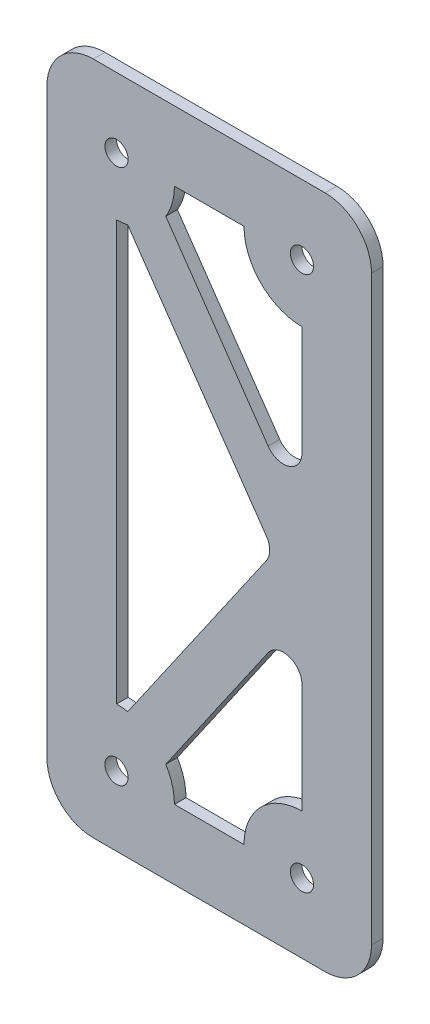
ISO-10303-21;
HEADER;
FILE_DESCRIPTION(('STEP AP214'),'2;1');
FILE_NAME('part.step','',(''),(''),'','','');
FILE_SCHEMA(('AUTOMOTIVE_DESIGN { 1 0 10303 214 1 1 1 1 }'));
ENDSEC;
DATA;
#1=APPLICATION_CONTEXT('core data for automotive mechanical design processes');
#2=APPLICATION_PROTOCOL_DEFINITION('international standard','automotive_design',2000,#1);
#3=PRODUCT_CONTEXT('',#1,'mechanical');
#4=PRODUCT('Part','Part','',(#3));
#5=PRODUCT_RELATED_PRODUCT_CATEGORY('part','',(#4));
#6=PRODUCT_DEFINITION_FORMATION('','',#4);
#7=PRODUCT_DEFINITION_CONTEXT('part definition',#1,'design');
#8=PRODUCT_DEFINITION('design','',#6,#7);
#9=PRODUCT_DEFINITION_SHAPE('','',#8);
#10=(LENGTH_UNIT() NAMED_UNIT(*) SI_UNIT(.MILLI.,.METRE.));
#11=(NAMED_UNIT(*) PLANE_ANGLE_UNIT() SI_UNIT($,.RADIAN.));
#12=(NAMED_UNIT(*) SI_UNIT($,.STERADIAN.) SOLID_ANGLE_UNIT());
#13=UNCERTAINTY_MEASURE_WITH_UNIT(LENGTH_MEASURE(1.E-05),#10,'distance_accuracy_value','');
#14=(GEOMETRIC_REPRESENTATION_CONTEXT(3) GLOBAL_UNCERTAINTY_ASSIGNED_CONTEXT((#13)) GLOBAL_UNIT_ASSIGNED_CONTEXT((#10,
#11,#12)) REPRESENTATION_CONTEXT('',''));
#15=CARTESIAN_POINT('',(0.,0.,0.));
#16=DIRECTION('',(0.,0.,1.));
#17=DIRECTION('',(1.,0.,0.));
#18=AXIS2_PLACEMENT_3D('',#15,#16,#17);
#19=CARTESIAN_POINT('',(1667.86072109709,0.,3.175));
#20=DIRECTION('',(1.,0.,0.));
#21=DIRECTION('',(0.,0.,-1.));
#22=AXIS2_PLACEMENT_3D('',#19,#20,#21);
#23=PLANE('',#22);
#24=DIRECTION('',(0.,-1.,0.));
#25=VECTOR('',#24,1.);
#26=CARTESIAN_POINT('',(1667.86072109709,0.,0.));
#27=LINE('',#26,#25);
#28=CARTESIAN_POINT('',(1667.86072109709,-4100.18496013182,0.));
#29=VERTEX_POINT('',#28);
#30=CARTESIAN_POINT('',(1667.86072109709,-4259.54741898572,0.));
#31=VERTEX_POINT('',#30);
#32=EDGE_CURVE('E461',#29,#31,#27,.T.);
#33=ORIENTED_EDGE('',*,*,#32,.F.);
#34=DIRECTION('',(0.,0.,-1.));
#35=VECTOR('',#34,1.);
#36=CARTESIAN_POINT('',(1667.86072109709,-4100.18496013182,3.175));
#37=LINE('',#36,#35);
#38=CARTESIAN_POINT('',(1667.86072109709,-4100.18496013182,3.175));
#39=VERTEX_POINT('',#38);
#40=EDGE_CURVE('E314',#29,#39,#37,.F.);
#41=ORIENTED_EDGE('',*,*,#40,.T.);
#42=DIRECTION('',(0.,-1.,0.));
#43=VECTOR('',#42,1.);
#44=CARTESIAN_POINT('',(1667.86072109709,0.,3.175));
#45=LINE('',#44,#43);
#46=CARTESIAN_POINT('',(1667.86072109709,-4259.54741898572,3.175));
#47=VERTEX_POINT('',#46);
#48=EDGE_CURVE('E490',#39,#47,#45,.T.);
#49=ORIENTED_EDGE('',*,*,#48,.T.);
#50=DIRECTION('',(0.,0.,-1.));
#51=VECTOR('',#50,1.);
#52=CARTESIAN_POINT('',(1667.86072109709,-4259.54741898572,0.));
#53=LINE('',#52,#51);
#54=EDGE_CURVE('E310',#47,#31,#53,.T.);
#55=ORIENTED_EDGE('',*,*,#54,.T.);
#56=EDGE_LOOP('',(#33,#41,#49,#55));
#57=FACE_BOUND('',#56,.T.);
#58=ADVANCED_FACE('F38',(#57),#23,.T.);
#59=CARTESIAN_POINT('',(0.,-4087.48496013182,3.175));
#60=DIRECTION('',(0.,1.,0.));
#61=DIRECTION('',(0.,0.,1.));
#62=AXIS2_PLACEMENT_3D('',#59,#60,#61);
#63=PLANE('',#62);
#64=DIRECTION('',(1.,0.,0.));
#65=VECTOR('',#64,1.);
#66=CARTESIAN_POINT('',(0.,-4087.48496013182,3.175));
#67=LINE('',#66,#65);
#68=CARTESIAN_POINT('',(1591.66072109709,-4087.48496013182,3.175));
#69=VERTEX_POINT('',#68);
#70=CARTESIAN_POINT('',(1655.16072109709,-4087.48496013182,3.175));
#71=VERTEX_POINT('',#70);
#72=EDGE_CURVE('E481',#69,#71,#67,.T.);
#73=ORIENTED_EDGE('',*,*,#72,.T.);
#74=DIRECTION('',(0.,0.,-1.));
#75=VECTOR('',#74,1.);
#76=CARTESIAN_POINT('',(1655.16072109709,-4087.48496013182,3.175));
#77=LINE('',#76,#75);
#78=CARTESIAN_POINT('',(1655.16072109709,-4087.48496013182,0.));
#79=VERTEX_POINT('',#78);
#80=EDGE_CURVE('E294',#71,#79,#77,.T.);
#81=ORIENTED_EDGE('',*,*,#80,.T.);
#82=DIRECTION('',(1.,0.,0.));
#83=VECTOR('',#82,1.);
#84=CARTESIAN_POINT('',(0.,-4087.48496013182,0.));
#85=LINE('',#84,#83);
#86=CARTESIAN_POINT('',(1591.66072109709,-4087.48496013182,0.));
#87=VERTEX_POINT('',#86);
#88=EDGE_CURVE('E357',#87,#79,#85,.T.);
#89=ORIENTED_EDGE('',*,*,#88,.F.);
#90=DIRECTION('',(0.,0.,-1.));
#91=VECTOR('',#90,1.);
#92=CARTESIAN_POINT('',(1591.66072109709,-4087.48496013182,3.175));
#93=LINE('',#92,#91);
#94=EDGE_CURVE('E291',#87,#69,#93,.F.);
#95=ORIENTED_EDGE('',*,*,#94,.T.);
#96=EDGE_LOOP('',(#73,#81,#89,#95));
#97=FACE_BOUND('',#96,.T.);
#98=ADVANCED_FACE('F471',(#97),#63,.T.);
#99=CARTESIAN_POINT('',(1578.96072109709,0.,3.175));
#100=DIRECTION('',(1.,0.,0.));
#101=DIRECTION('',(0.,0.,-1.));
#102=AXIS2_PLACEMENT_3D('',#99,#100,#101);
#103=PLANE('',#102);
#104=DIRECTION('',(0.,-1.,0.));
#105=VECTOR('',#104,1.);
#106=CARTESIAN_POINT('',(1578.96072109709,0.,3.175));
#107=LINE('',#106,#105);
#108=CARTESIAN_POINT('',(1578.96072109709,-4100.18496013182,3.175));
#109=VERTEX_POINT('',#108);
#110=CARTESIAN_POINT('',(1578.96072109709,-4259.54741898572,3.175));
#111=VERTEX_POINT('',#110);
#112=EDGE_CURVE('E480',#109,#111,#107,.T.);
#113=ORIENTED_EDGE('',*,*,#112,.F.);
#114=DIRECTION('',(0.,0.,-1.));
#115=VECTOR('',#114,1.);
#116=CARTESIAN_POINT('',(1578.96072109709,-4100.18496013182,0.));
#117=LINE('',#116,#115);
#118=CARTESIAN_POINT('',(1578.96072109709,-4100.18496013182,0.));
#119=VERTEX_POINT('',#118);
#120=EDGE_CURVE('E331',#109,#119,#117,.T.);
#121=ORIENTED_EDGE('',*,*,#120,.T.);
#122=DIRECTION('',(0.,-1.,0.));
#123=VECTOR('',#122,1.);
#124=CARTESIAN_POINT('',(1578.96072109709,0.,0.));
#125=LINE('',#124,#123);
#126=CARTESIAN_POINT('',(1578.96072109709,-4259.54741898572,0.));
#127=VERTEX_POINT('',#126);
#128=EDGE_CURVE('E351',#119,#127,#125,.T.);
#129=ORIENTED_EDGE('',*,*,#128,.T.);
#130=DIRECTION('',(0.,0.,-1.));
#131=VECTOR('',#130,1.);
#132=CARTESIAN_POINT('',(1578.96072109709,-4259.54741898572,3.175));
#133=LINE('',#132,#131);
#134=EDGE_CURVE('E328',#127,#111,#133,.F.);
#135=ORIENTED_EDGE('',*,*,#134,.T.);
#136=EDGE_LOOP('',(#113,#121,#129,#135));
#137=FACE_BOUND('',#136,.T.);
#138=ADVANCED_FACE('F483',(#137),#103,.F.);
#139=CARTESIAN_POINT('',(1648.81072109709,-4253.19741898572,3.175));
#140=DIRECTION('',(0.,0.,-1.));
#141=DIRECTION('',(-1.,0.,0.));
#142=AXIS2_PLACEMENT_3D('',#139,#140,#141);
#143=CYLINDRICAL_SURFACE('',#142,15.8749999999997);
#144=CARTESIAN_POINT('',(1648.81072109709,-4253.19741898572,0.));
#145=DIRECTION('',(0.,0.,1.));
#146=DIRECTION('',(1.,0.,0.));
#147=AXIS2_PLACEMENT_3D('',#144,#145,#146);
#148=CIRCLE('',#147,15.8749999999997);
#149=CARTESIAN_POINT('',(1648.81072109709,-4237.32241898572,0.));
#150=VERTEX_POINT('',#149);
#151=CARTESIAN_POINT('',(1632.93572109709,-4253.19741898572,0.));
#152=VERTEX_POINT('',#151);
#153=EDGE_CURVE('E439',#150,#152,#148,.T.);
#154=ORIENTED_EDGE('',*,*,#153,.T.);
#155=DIRECTION('',(0.,0.,-1.));
#156=VECTOR('',#155,1.);
#157=CARTESIAN_POINT('',(1632.93572109709,-4253.19741898572,3.175));
#158=LINE('',#157,#156);
#159=CARTESIAN_POINT('',(1632.93572109709,-4253.19741898572,3.175));
#160=VERTEX_POINT('',#159);
#161=EDGE_CURVE('E258',#160,#152,#158,.T.);
#162=ORIENTED_EDGE('',*,*,#161,.F.);
#163=CARTESIAN_POINT('',(1648.81072109709,-4253.19741898572,3.175));
#164=DIRECTION('',(0.,0.,1.));
#165=DIRECTION('',(1.,0.,0.));
#166=AXIS2_PLACEMENT_3D('',#163,#164,#165);
#167=CIRCLE('',#166,15.8749999999997);
#168=CARTESIAN_POINT('',(1648.81072109709,-4237.32241898572,3.175));
#169=VERTEX_POINT('',#168);
#170=EDGE_CURVE('E528',#169,#160,#167,.T.);
#171=ORIENTED_EDGE('',*,*,#170,.F.);
#172=DIRECTION('',(0.,0.,-1.));
#173=VECTOR('',#172,1.);
#174=CARTESIAN_POINT('',(1648.81072109709,-4237.32241898572,3.175));
#175=LINE('',#174,#173);
#176=EDGE_CURVE('E361',#169,#150,#175,.T.);
#177=ORIENTED_EDGE('',*,*,#176,.T.);
#178=EDGE_LOOP('',(#154,#162,#171,#177));
#179=FACE_BOUND('',#178,.T.);
#180=ADVANCED_FACE('F597',(#179),#143,.T.);
#181=CARTESIAN_POINT('',(7.43621685485709E-11,-4253.19741898575,3.175));
#182=DIRECTION('',(0.,-1.,0.));
#183=DIRECTION('',(1.,0.,0.));
#184=AXIS2_PLACEMENT_3D('',#181,#182,#183);
#185=PLANE('',#184);
#186=DIRECTION('',(-1.,0.,0.));
#187=VECTOR('',#186,1.);
#188=CARTESIAN_POINT('',(7.43621685485709E-11,-4253.19741898575,0.));
#189=LINE('',#188,#187);
#190=CARTESIAN_POINT('',(1613.88572109709,-4253.19741898572,0.));
#191=VERTEX_POINT('',#190);
#192=EDGE_CURVE('E443',#152,#191,#189,.T.);
#193=ORIENTED_EDGE('',*,*,#192,.T.);
#194=DIRECTION('',(0.,0.,-1.));
#195=VECTOR('',#194,1.);
#196=CARTESIAN_POINT('',(1613.88572109709,-4253.19741898572,3.175));
#197=LINE('',#196,#195);
#198=CARTESIAN_POINT('',(1613.88572109709,-4253.19741898572,3.175));
#199=VERTEX_POINT('',#198);
#200=EDGE_CURVE('E370',#199,#191,#197,.T.);
#201=ORIENTED_EDGE('',*,*,#200,.F.);
#202=DIRECTION('',(-1.,0.,0.));
#203=VECTOR('',#202,1.);
#204=CARTESIAN_POINT('',(7.43621685485709E-11,-4253.19741898575,3.175));
#205=LINE('',#204,#203);
#206=EDGE_CURVE('E532',#160,#199,#205,.T.);
#207=ORIENTED_EDGE('',*,*,#206,.F.);
#208=ORIENTED_EDGE('',*,*,#161,.T.);
#209=EDGE_LOOP('',(#193,#201,#207,#208));
#210=FACE_BOUND('',#209,.T.);
#211=ADVANCED_FACE('F593',(#210),#185,.F.);
#212=CARTESIAN_POINT('',(1598.01072109709,-4253.19741898572,3.175));
#213=DIRECTION('',(0.,0.,-1.));
#214=DIRECTION('',(-1.,0.,0.));
#215=AXIS2_PLACEMENT_3D('',#212,#213,#214);
#216=CYLINDRICAL_SURFACE('',#215,15.8749999999997);
#217=CARTESIAN_POINT('',(1598.01072109709,-4253.19741898572,0.));
#218=DIRECTION('',(0.,0.,1.));
#219=DIRECTION('',(1.,0.,0.));
#220=AXIS2_PLACEMENT_3D('',#217,#218,#219);
#221=CIRCLE('',#220,15.8749999999997);
#222=CARTESIAN_POINT('',(1611.51594221686,-4244.85328167225,0.));
#223=VERTEX_POINT('',#222);
#224=EDGE_CURVE('E446',#191,#223,#221,.T.);
#225=ORIENTED_EDGE('',*,*,#224,.T.);
#226=DIRECTION('',(0.,0.,-1.));
#227=VECTOR('',#226,1.);
#228=CARTESIAN_POINT('',(1611.51594221686,-4244.85328167225,3.175));
#229=LINE('',#228,#227);
#230=CARTESIAN_POINT('',(1611.51594221686,-4244.85328167225,3.175));
#231=VERTEX_POINT('',#230);
#232=EDGE_CURVE('E365',#231,#223,#229,.T.);
#233=ORIENTED_EDGE('',*,*,#232,.F.);
#234=CARTESIAN_POINT('',(1598.01072109709,-4253.19741898572,3.175));
#235=DIRECTION('',(0.,0.,1.));
#236=DIRECTION('',(1.,0.,0.));
#237=AXIS2_PLACEMENT_3D('',#234,#235,#236);
#238=CIRCLE('',#237,15.8749999999997);
#239=EDGE_CURVE('E535',#199,#231,#238,.T.);
#240=ORIENTED_EDGE('',*,*,#239,.F.);
#241=ORIENTED_EDGE('',*,*,#200,.T.);
#242=EDGE_LOOP('',(#225,#233,#240,#241));
#243=FACE_BOUND('',#242,.T.);
#244=ADVANCED_FACE('F589',(#243),#216,.T.);
#245=CARTESIAN_POINT('',(3075.97149747778,-2130.87048032548,3.175));
#246=DIRECTION('',(0.822023094017505,-0.56945415346794,0.));
#247=DIRECTION('',(0.56945415346794,0.822023094017505,0.));
#248=AXIS2_PLACEMENT_3D('',#245,#246,#247);
#249=PLANE('',#248);
#250=DIRECTION('',(-0.56945415346794,-0.822023094017505,0.));
#251=VECTOR('',#250,1.);
#252=CARTESIAN_POINT('',(3075.97149747778,-2130.87048032548,0.));
#253=LINE('',#252,#251);
#254=CARTESIAN_POINT('',(1639.55484377948,-4204.37833829886,0.));
#255=VERTEX_POINT('',#254);
#256=EDGE_CURVE('E450',#255,#223,#253,.T.);
#257=ORIENTED_EDGE('',*,*,#256,.F.);
#258=DIRECTION('',(0.,0.,-1.));
#259=VECTOR('',#258,1.);
#260=CARTESIAN_POINT('',(1639.55484377948,-4204.37833829885,3.175));
#261=LINE('',#260,#259);
#262=CARTESIAN_POINT('',(1639.55484377948,-4204.37833829886,3.175));
#263=VERTEX_POINT('',#262);
#264=EDGE_CURVE('E265',#255,#263,#261,.F.);
#265=ORIENTED_EDGE('',*,*,#264,.T.);
#266=DIRECTION('',(-0.56945415346794,-0.822023094017505,0.));
#267=VECTOR('',#266,1.);
#268=CARTESIAN_POINT('',(3075.97149747778,-2130.87048032548,3.175));
#269=LINE('',#268,#267);
#270=EDGE_CURVE('E538',#263,#231,#269,.T.);
#271=ORIENTED_EDGE('',*,*,#270,.T.);
#272=ORIENTED_EDGE('',*,*,#232,.T.);
#273=EDGE_LOOP('',(#257,#265,#271,#272));
#274=FACE_BOUND('',#273,.T.);
#275=ADVANCED_FACE('F585',(#274),#249,.T.);
#276=CARTESIAN_POINT('',(1598.01072109709,-4106.53496013182,3.175));
#277=DIRECTION('',(0.,0.,-1.));
#278=DIRECTION('',(-1.,0.,0.));
#279=AXIS2_PLACEMENT_3D('',#276,#277,#278);
#280=CYLINDRICAL_SURFACE('',#279,15.8749999999997);
#281=CARTESIAN_POINT('',(1598.01072109709,-4106.53496013182,0.));
#282=DIRECTION('',(0.,0.,1.));
#283=DIRECTION('',(1.,0.,0.));
#284=AXIS2_PLACEMENT_3D('',#281,#282,#283);
#285=CIRCLE('',#284,15.8749999999997);
#286=CARTESIAN_POINT('',(1598.01072109709,-4122.40996013182,0.));
#287=VERTEX_POINT('',#286);
#288=CARTESIAN_POINT('',(1601.07624892284,-4122.11116519433,0.));
#289=VERTEX_POINT('',#288);
#290=EDGE_CURVE('E412',#287,#289,#285,.T.);
#291=ORIENTED_EDGE('',*,*,#290,.T.);
#292=DIRECTION('',(0.,0.,-1.));
#293=VECTOR('',#292,1.);
#294=CARTESIAN_POINT('',(1601.07624892284,-4122.11116519433,3.175));
#295=LINE('',#294,#293);
#296=CARTESIAN_POINT('',(1601.07624892284,-4122.11116519433,3.175));
#297=VERTEX_POINT('',#296);
#298=EDGE_CURVE('E366',#297,#289,#295,.T.);
#299=ORIENTED_EDGE('',*,*,#298,.F.);
#300=CARTESIAN_POINT('',(1598.01072109709,-4106.53496013182,3.175));
#301=DIRECTION('',(0.,0.,1.));
#302=DIRECTION('',(1.,0.,0.));
#303=AXIS2_PLACEMENT_3D('',#300,#301,#302);
#304=CIRCLE('',#303,15.8749999999997);
#305=CARTESIAN_POINT('',(1598.01072109709,-4122.40996013182,3.175));
#306=VERTEX_POINT('',#305);
#307=EDGE_CURVE('E507',#306,#297,#304,.T.);
#308=ORIENTED_EDGE('',*,*,#307,.F.);
#309=DIRECTION('',(0.,0.,-1.));
#310=VECTOR('',#309,1.);
#311=CARTESIAN_POINT('',(1598.01072109709,-4122.40996013182,3.175));
#312=LINE('',#311,#310);
#313=EDGE_CURVE('E242',#306,#287,#312,.T.);
#314=ORIENTED_EDGE('',*,*,#313,.T.);
#315=EDGE_LOOP('',(#291,#299,#308,#314));
#316=FACE_BOUND('',#315,.T.);
#317=ADVANCED_FACE('F588',(#316),#280,.T.);
#318=CARTESIAN_POINT('',(-847.696249813411,-587.239158910005,3.175));
#319=DIRECTION('',(-0.822023094017507,-0.569454153467937,0.));
#320=DIRECTION('',(0.569454153467937,-0.822023094017507,0.));
#321=AXIS2_PLACEMENT_3D('',#318,#319,#320);
#322=PLANE('',#321);
#323=DIRECTION('',(-0.569454153467937,0.822023094017507,0.));
#324=VECTOR('',#323,1.);
#325=CARTESIAN_POINT('',(-847.696249813411,-587.239158910005,0.));
#326=LINE('',#325,#324);
#327=CARTESIAN_POINT('',(1639.08187957749,-4176.97336245915,0.));
#328=VERTEX_POINT('',#327);
#329=EDGE_CURVE('E423',#328,#289,#326,.T.);
#330=ORIENTED_EDGE('',*,*,#329,.F.);
#331=DIRECTION('',(0.,0.,-1.));
#332=VECTOR('',#331,1.);
#333=CARTESIAN_POINT('',(1639.08187957749,-4176.97336245915,3.175));
#334=LINE('',#333,#332);
#335=CARTESIAN_POINT('',(1639.08187957749,-4176.97336245915,3.175));
#336=VERTEX_POINT('',#335);
#337=EDGE_CURVE('E257',#328,#336,#334,.F.);
#338=ORIENTED_EDGE('',*,*,#337,.T.);
#339=DIRECTION('',(-0.569454153467937,0.822023094017507,0.));
#340=VECTOR('',#339,1.);
#341=CARTESIAN_POINT('',(-847.696249813411,-587.239158910005,3.175));
#342=LINE('',#341,#340);
#343=EDGE_CURVE('E512',#336,#297,#342,.T.);
#344=ORIENTED_EDGE('',*,*,#343,.T.);
#345=ORIENTED_EDGE('',*,*,#298,.T.);
#346=EDGE_LOOP('',(#330,#338,#344,#345));
#347=FACE_BOUND('',#346,.T.);
#348=ADVANCED_FACE('F616',(#347),#322,.T.);
#349=CARTESIAN_POINT('',(3065.53180418376,-2123.63841257638,3.175));
#350=DIRECTION('',(0.822023094017512,-0.569454153467929,0.));
#351=DIRECTION('',(0.569454153467929,0.822023094017512,0.));
#352=AXIS2_PLACEMENT_3D('',#349,#350,#351);
#353=PLANE('',#352);
#354=DIRECTION('',(-0.569454153467929,-0.822023094017512,0.));
#355=VECTOR('',#354,1.);
#356=CARTESIAN_POINT('',(3065.53180418376,-2123.63841257638,3.175));
#357=LINE('',#356,#355);
#358=CARTESIAN_POINT('',(1639.08187957749,-4182.75901665839,3.175));
#359=VERTEX_POINT('',#358);
#360=CARTESIAN_POINT('',(1601.07624892284,-4237.6212139232,3.175));
#361=VERTEX_POINT('',#360);
#362=EDGE_CURVE('E515',#359,#361,#357,.T.);
#363=ORIENTED_EDGE('',*,*,#362,.F.);
#364=DIRECTION('',(0.,0.,-1.));
#365=VECTOR('',#364,1.);
#366=CARTESIAN_POINT('',(1639.08187957749,-4182.75901665839,3.175));
#367=LINE('',#366,#365);
#368=CARTESIAN_POINT('',(1639.08187957749,-4182.75901665839,0.));
#369=VERTEX_POINT('',#368);
#370=EDGE_CURVE('E253',#359,#369,#367,.T.);
#371=ORIENTED_EDGE('',*,*,#370,.T.);
#372=DIRECTION('',(-0.569454153467929,-0.822023094017512,0.));
#373=VECTOR('',#372,1.);
#374=CARTESIAN_POINT('',(3065.53180418376,-2123.63841257638,0.));
#375=LINE('',#374,#373);
#376=CARTESIAN_POINT('',(1601.07624892284,-4237.6212139232,0.));
#377=VERTEX_POINT('',#376);
#378=EDGE_CURVE('E426',#369,#377,#375,.T.);
#379=ORIENTED_EDGE('',*,*,#378,.T.);
#380=DIRECTION('',(0.,0.,-1.));
#381=VECTOR('',#380,1.);
#382=CARTESIAN_POINT('',(1601.07624892284,-4237.6212139232,3.175));
#383=LINE('',#382,#381);
#384=EDGE_CURVE('E380',#361,#377,#383,.T.);
#385=ORIENTED_EDGE('',*,*,#384,.F.);
#386=EDGE_LOOP('',(#363,#371,#379,#385));
#387=FACE_BOUND('',#386,.T.);
#388=ADVANCED_FACE('F612',(#387),#353,.F.);
#389=CARTESIAN_POINT('',(1598.01072109709,-4253.19741898572,3.175));
#390=DIRECTION('',(0.,0.,-1.));
#391=DIRECTION('',(-1.,0.,0.));
#392=AXIS2_PLACEMENT_3D('',#389,#390,#391);
#393=CYLINDRICAL_SURFACE('',#392,15.8749999999997);
#394=CARTESIAN_POINT('',(1598.01072109709,-4253.19741898572,0.));
#395=DIRECTION('',(0.,0.,1.));
#396=DIRECTION('',(1.,0.,0.));
#397=AXIS2_PLACEMENT_3D('',#394,#395,#396);
#398=CIRCLE('',#397,15.8749999999997);
#399=CARTESIAN_POINT('',(1598.01072109709,-4237.32241898572,0.));
#400=VERTEX_POINT('',#399);
#401=EDGE_CURVE('E429',#377,#400,#398,.T.);
#402=ORIENTED_EDGE('',*,*,#401,.T.);
#403=DIRECTION('',(0.,0.,-1.));
#404=VECTOR('',#403,1.);
#405=CARTESIAN_POINT('',(1598.01072109709,-4237.32241898572,3.175));
#406=LINE('',#405,#404);
#407=CARTESIAN_POINT('',(1598.01072109709,-4237.32241898572,3.175));
#408=VERTEX_POINT('',#407);
#409=EDGE_CURVE('E246',#408,#400,#406,.T.);
#410=ORIENTED_EDGE('',*,*,#409,.F.);
#411=CARTESIAN_POINT('',(1598.01072109709,-4253.19741898572,3.175));
#412=DIRECTION('',(0.,0.,1.));
#413=DIRECTION('',(1.,0.,0.));
#414=AXIS2_PLACEMENT_3D('',#411,#412,#413);
#415=CIRCLE('',#414,15.8749999999997);
#416=EDGE_CURVE('E518',#361,#408,#415,.T.);
#417=ORIENTED_EDGE('',*,*,#416,.F.);
#418=ORIENTED_EDGE('',*,*,#384,.T.);
#419=EDGE_LOOP('',(#402,#410,#417,#418));
#420=FACE_BOUND('',#419,.T.);
#421=ADVANCED_FACE('F609',(#420),#393,.T.);
#422=CARTESIAN_POINT('',(-837.256556519391,-580.007091160965,3.175));
#423=DIRECTION('',(-0.822023094017507,-0.569454153467938,0.));
#424=DIRECTION('',(0.569454153467938,-0.822023094017507,0.));
#425=AXIS2_PLACEMENT_3D('',#422,#423,#424);
#426=PLANE('',#425);
#427=DIRECTION('',(-0.569454153467938,0.822023094017507,0.));
#428=VECTOR('',#427,1.);
#429=CARTESIAN_POINT('',(-837.256556519391,-580.007091160965,3.175));
#430=LINE('',#429,#428);
#431=CARTESIAN_POINT('',(1639.55484377948,-4155.35404081868,3.175));
#432=VERTEX_POINT('',#431);
#433=CARTESIAN_POINT('',(1611.51594221686,-4114.87909744529,3.175));
#434=VERTEX_POINT('',#433);
#435=EDGE_CURVE('E211',#432,#434,#430,.T.);
#436=ORIENTED_EDGE('',*,*,#435,.F.);
#437=DIRECTION('',(0.,0.,-1.));
#438=VECTOR('',#437,1.);
#439=CARTESIAN_POINT('',(1639.55484377948,-4155.35404081868,0.));
#440=LINE('',#439,#438);
#441=CARTESIAN_POINT('',(1639.55484377948,-4155.35404081868,0.));
#442=VERTEX_POINT('',#441);
#443=EDGE_CURVE('E268',#432,#442,#440,.T.);
#444=ORIENTED_EDGE('',*,*,#443,.T.);
#445=DIRECTION('',(-0.569454153467938,0.822023094017507,0.));
#446=VECTOR('',#445,1.);
#447=CARTESIAN_POINT('',(-837.256556519391,-580.007091160965,0.));
#448=LINE('',#447,#446);
#449=CARTESIAN_POINT('',(1611.51594221686,-4114.87909744529,0.));
#450=VERTEX_POINT('',#449);
#451=EDGE_CURVE('E239',#442,#450,#448,.T.);
#452=ORIENTED_EDGE('',*,*,#451,.T.);
#453=DIRECTION('',(0.,0.,-1.));
#454=VECTOR('',#453,1.);
#455=CARTESIAN_POINT('',(1611.51594221686,-4114.87909744529,3.175));
#456=LINE('',#455,#454);
#457=EDGE_CURVE('E230',#434,#450,#456,.T.);
#458=ORIENTED_EDGE('',*,*,#457,.F.);
#459=EDGE_LOOP('',(#436,#444,#452,#458));
#460=FACE_BOUND('',#459,.T.);
#461=ADVANCED_FACE('F237',(#460),#426,.F.);
#462=CARTESIAN_POINT('',(1598.01072109709,-4106.53496013182,3.175));
#463=DIRECTION('',(0.,0.,-1.));
#464=DIRECTION('',(-1.,0.,0.));
#465=AXIS2_PLACEMENT_3D('',#462,#463,#464);
#466=CYLINDRICAL_SURFACE('',#465,15.8749999999997);
#467=CARTESIAN_POINT('',(1598.01072109709,-4106.53496013182,0.));
#468=DIRECTION('',(0.,0.,1.));
#469=DIRECTION('',(1.,0.,0.));
#470=AXIS2_PLACEMENT_3D('',#467,#468,#469);
#471=CIRCLE('',#470,15.8749999999997);
#472=CARTESIAN_POINT('',(1613.88572109709,-4106.53496013182,0.));
#473=VERTEX_POINT('',#472);
#474=EDGE_CURVE('E416',#450,#473,#471,.T.);
#475=ORIENTED_EDGE('',*,*,#474,.T.);
#476=DIRECTION('',(0.,0.,-1.));
#477=VECTOR('',#476,1.);
#478=CARTESIAN_POINT('',(1613.88572109709,-4106.53496013182,3.175));
#479=LINE('',#478,#477);
#480=CARTESIAN_POINT('',(1613.88572109709,-4106.53496013182,3.175));
#481=VERTEX_POINT('',#480);
#482=EDGE_CURVE('E232',#481,#473,#479,.T.);
#483=ORIENTED_EDGE('',*,*,#482,.F.);
#484=CARTESIAN_POINT('',(1598.01072109709,-4106.53496013182,3.175));
#485=DIRECTION('',(0.,0.,1.));
#486=DIRECTION('',(1.,0.,0.));
#487=AXIS2_PLACEMENT_3D('',#484,#485,#486);
#488=CIRCLE('',#487,15.8749999999997);
#489=EDGE_CURVE('E216',#434,#481,#488,.T.);
#490=ORIENTED_EDGE('',*,*,#489,.F.);
#491=ORIENTED_EDGE('',*,*,#457,.T.);
#492=EDGE_LOOP('',(#475,#483,#490,#491));
#493=FACE_BOUND('',#492,.T.);
#494=ADVANCED_FACE('F229',(#493),#466,.T.);
#495=CARTESIAN_POINT('',(7.17979474671891E-11,-4106.53496013184,3.175));
#496=DIRECTION('',(0.,1.,0.));
#497=DIRECTION('',(-1.,0.,0.));
#498=AXIS2_PLACEMENT_3D('',#495,#496,#497);
#499=PLANE('',#498);
#500=DIRECTION('',(1.,0.,0.));
#501=VECTOR('',#500,1.);
#502=CARTESIAN_POINT('',(7.17979474671891E-11,-4106.53496013184,0.));
#503=LINE('',#502,#501);
#504=CARTESIAN_POINT('',(1632.93572109709,-4106.53496013182,0.));
#505=VERTEX_POINT('',#504);
#506=EDGE_CURVE('E405',#473,#505,#503,.T.);
#507=ORIENTED_EDGE('',*,*,#506,.T.);
#508=DIRECTION('',(0.,0.,-1.));
#509=VECTOR('',#508,1.);
#510=CARTESIAN_POINT('',(1632.93572109709,-4106.53496013182,3.175));
#511=LINE('',#510,#509);
#512=CARTESIAN_POINT('',(1632.93572109709,-4106.53496013182,3.175));
#513=VERTEX_POINT('',#512);
#514=EDGE_CURVE('E249',#513,#505,#511,.T.);
#515=ORIENTED_EDGE('',*,*,#514,.F.);
#516=DIRECTION('',(1.,0.,0.));
#517=VECTOR('',#516,1.);
#518=CARTESIAN_POINT('',(7.17979474671891E-11,-4106.53496013184,3.175));
#519=LINE('',#518,#517);
#520=EDGE_CURVE('E235',#481,#513,#519,.T.);
#521=ORIENTED_EDGE('',*,*,#520,.F.);
#522=ORIENTED_EDGE('',*,*,#482,.T.);
#523=EDGE_LOOP('',(#507,#515,#521,#522));
#524=FACE_BOUND('',#523,.T.);
#525=ADVANCED_FACE('F499',(#524),#499,.F.);
#526=CARTESIAN_POINT('',(1648.81072109709,-4106.53496013182,3.175));
#527=DIRECTION('',(0.,0.,-1.));
#528=DIRECTION('',(-1.,0.,0.));
#529=AXIS2_PLACEMENT_3D('',#526,#527,#528);
#530=CYLINDRICAL_SURFACE('',#529,15.8749999999997);
#531=CARTESIAN_POINT('',(1648.81072109709,-4106.53496013182,0.));
#532=DIRECTION('',(0.,0.,1.));
#533=DIRECTION('',(1.,0.,0.));
#534=AXIS2_PLACEMENT_3D('',#531,#532,#533);
#535=CIRCLE('',#534,15.8749999999997);
#536=CARTESIAN_POINT('',(1648.81072109709,-4122.40996013182,0.));
#537=VERTEX_POINT('',#536);
#538=EDGE_CURVE('E398',#505,#537,#535,.T.);
#539=ORIENTED_EDGE('',*,*,#538,.T.);
#540=DIRECTION('',(0.,0.,-1.));
#541=VECTOR('',#540,1.);
#542=CARTESIAN_POINT('',(1648.81072109709,-4122.40996013182,3.175));
#543=LINE('',#542,#541);
#544=CARTESIAN_POINT('',(1648.81072109709,-4122.40996013182,3.175));
#545=VERTEX_POINT('',#544);
#546=EDGE_CURVE('E387',#545,#537,#543,.T.);
#547=ORIENTED_EDGE('',*,*,#546,.F.);
#548=CARTESIAN_POINT('',(1648.81072109709,-4106.53496013182,3.175));
#549=DIRECTION('',(0.,0.,1.));
#550=DIRECTION('',(1.,0.,0.));
#551=AXIS2_PLACEMENT_3D('',#548,#549,#550);
#552=CIRCLE('',#551,15.8749999999997);
#553=EDGE_CURVE('E399',#513,#545,#552,.T.);
#554=ORIENTED_EDGE('',*,*,#553,.F.);
#555=ORIENTED_EDGE('',*,*,#514,.T.);
#556=EDGE_LOOP('',(#539,#547,#554,#555));
#557=FACE_BOUND('',#556,.T.);
#558=ADVANCED_FACE('F396',(#557),#530,.T.);
#559=CARTESIAN_POINT('',(1598.01072109709,-4253.19741898572,3.175));
#560=DIRECTION('',(0.,0.,-1.));
#561=DIRECTION('',(-1.,0.,0.));
#562=AXIS2_PLACEMENT_3D('',#559,#560,#561);
#563=CYLINDRICAL_SURFACE('',#562,3.17499999999975);
#564=CARTESIAN_POINT('',(1598.01072109709,-4253.19741898572,3.175));
#565=DIRECTION('',(0.,0.,1.));
#566=DIRECTION('',(1.,0.,0.));
#567=AXIS2_PLACEMENT_3D('',#564,#565,#566);
#568=CIRCLE('',#567,3.17499999999975);
#569=CARTESIAN_POINT('',(1601.18572109709,-4253.19741898572,3.175));
#570=VERTEX_POINT('',#569);
#571=EDGE_CURVE('E545',#570,#570,#568,.T.);
#572=ORIENTED_EDGE('',*,*,#571,.T.);
#573=EDGE_LOOP('',(#572));
#574=FACE_BOUND('',#573,.T.);
#575=CARTESIAN_POINT('',(1598.01072109709,-4253.19741898572,0.));
#576=DIRECTION('',(0.,0.,1.));
#577=DIRECTION('',(1.,0.,0.));
#578=AXIS2_PLACEMENT_3D('',#575,#576,#577);
#579=CIRCLE('',#578,3.17499999999975);
#580=CARTESIAN_POINT('',(1601.18572109709,-4253.19741898572,0.));
#581=VERTEX_POINT('',#580);
#582=EDGE_CURVE('E457',#581,#581,#579,.T.);
#583=ORIENTED_EDGE('',*,*,#582,.F.);
#584=EDGE_LOOP('',(#583));
#585=FACE_BOUND('',#584,.T.);
#586=ADVANCED_FACE('F571',(#574,#585),#563,.F.);
#587=CARTESIAN_POINT('',(1648.81072109709,-4253.19741898572,3.175));
#588=DIRECTION('',(0.,0.,-1.));
#589=DIRECTION('',(-1.,0.,0.));
#590=AXIS2_PLACEMENT_3D('',#587,#588,#589);
#591=CYLINDRICAL_SURFACE('',#590,3.17499999999975);
#592=CARTESIAN_POINT('',(1648.81072109709,-4253.19741898572,3.175));
#593=DIRECTION('',(0.,0.,1.));
#594=DIRECTION('',(1.,0.,0.));
#595=AXIS2_PLACEMENT_3D('',#592,#593,#594);
#596=CIRCLE('',#595,3.17499999999975);
#597=CARTESIAN_POINT('',(1651.98572109709,-4253.19741898572,3.175));
#598=VERTEX_POINT('',#597);
#599=EDGE_CURVE('E541',#598,#598,#596,.T.);
#600=ORIENTED_EDGE('',*,*,#599,.T.);
#601=EDGE_LOOP('',(#600));
#602=FACE_BOUND('',#601,.T.);
#603=CARTESIAN_POINT('',(1648.81072109709,-4253.19741898572,0.));
#604=DIRECTION('',(0.,0.,1.));
#605=DIRECTION('',(1.,0.,0.));
#606=AXIS2_PLACEMENT_3D('',#603,#604,#605);
#607=CIRCLE('',#606,3.17499999999975);
#608=CARTESIAN_POINT('',(1651.98572109709,-4253.19741898572,0.));
#609=VERTEX_POINT('',#608);
#610=EDGE_CURVE('E453',#609,#609,#607,.T.);
#611=ORIENTED_EDGE('',*,*,#610,.F.);
#612=EDGE_LOOP('',(#611));
#613=FACE_BOUND('',#612,.T.);
#614=ADVANCED_FACE('F574',(#602,#613),#591,.F.);
#615=CARTESIAN_POINT('',(1648.81072109706,1.24813646253826E-11,3.175));
#616=DIRECTION('',(1.,0.,0.));
#617=DIRECTION('',(0.,1.,0.));
#618=AXIS2_PLACEMENT_3D('',#615,#616,#617);
#619=PLANE('',#618);
#620=DIRECTION('',(0.,-1.,0.));
#621=VECTOR('',#620,1.);
#622=CARTESIAN_POINT('',(1648.81072109706,1.24813646253826E-11,3.175));
#623=LINE('',#622,#621);
#624=CARTESIAN_POINT('',(1648.81072109709,-4207.27116539847,3.175));
#625=VERTEX_POINT('',#624);
#626=EDGE_CURVE('E508',#625,#169,#623,.T.);
#627=ORIENTED_EDGE('',*,*,#626,.F.);
#628=DIRECTION('',(0.,0.,-1.));
#629=VECTOR('',#628,1.);
#630=CARTESIAN_POINT('',(1648.81072109709,-4207.27116539847,3.175));
#631=LINE('',#630,#629);
#632=CARTESIAN_POINT('',(1648.81072109709,-4207.27116539847,0.));
#633=VERTEX_POINT('',#632);
#634=EDGE_CURVE('E261',#625,#633,#631,.T.);
#635=ORIENTED_EDGE('',*,*,#634,.T.);
#636=DIRECTION('',(0.,-1.,0.));
#637=VECTOR('',#636,1.);
#638=CARTESIAN_POINT('',(1648.81072109706,1.24813646253826E-11,0.));
#639=LINE('',#638,#637);
#640=EDGE_CURVE('E414',#633,#150,#639,.T.);
#641=ORIENTED_EDGE('',*,*,#640,.T.);
#642=ORIENTED_EDGE('',*,*,#176,.F.);
#643=EDGE_LOOP('',(#627,#635,#641,#642));
#644=FACE_BOUND('',#643,.T.);
#645=ADVANCED_FACE('F578',(#644),#619,.F.);
#646=CARTESIAN_POINT('',(1648.81072109709,-4106.53496013182,3.175));
#647=DIRECTION('',(0.,0.,-1.));
#648=DIRECTION('',(-1.,0.,0.));
#649=AXIS2_PLACEMENT_3D('',#646,#647,#648);
#650=CYLINDRICAL_SURFACE('',#649,3.17499999999975);
#651=CARTESIAN_POINT('',(1648.81072109709,-4106.53496013182,3.175));
#652=DIRECTION('',(0.,0.,1.));
#653=DIRECTION('',(1.,0.,0.));
#654=AXIS2_PLACEMENT_3D('',#651,#652,#653);
#655=CIRCLE('',#654,3.17499999999975);
#656=CARTESIAN_POINT('',(1651.98572109709,-4106.53496013182,3.175));
#657=VERTEX_POINT('',#656);
#658=EDGE_CURVE('E524',#657,#657,#655,.T.);
#659=ORIENTED_EDGE('',*,*,#658,.T.);
#660=EDGE_LOOP('',(#659));
#661=FACE_BOUND('',#660,.T.);
#662=CARTESIAN_POINT('',(1648.81072109709,-4106.53496013182,0.));
#663=DIRECTION('',(0.,0.,1.));
#664=DIRECTION('',(1.,0.,0.));
#665=AXIS2_PLACEMENT_3D('',#662,#663,#664);
#666=CIRCLE('',#665,3.17499999999975);
#667=CARTESIAN_POINT('',(1651.98572109709,-4106.53496013182,0.));
#668=VERTEX_POINT('',#667);
#669=EDGE_CURVE('E435',#668,#668,#666,.T.);
#670=ORIENTED_EDGE('',*,*,#669,.F.);
#671=EDGE_LOOP('',(#670));
#672=FACE_BOUND('',#671,.T.);
#673=ADVANCED_FACE('F582',(#661,#672),#650,.F.);
#674=CARTESIAN_POINT('',(1598.01072109706,1.20968127087457E-11,3.175));
#675=DIRECTION('',(-1.,0.,0.));
#676=DIRECTION('',(0.,-1.,0.));
#677=AXIS2_PLACEMENT_3D('',#674,#675,#676);
#678=PLANE('',#677);
#679=DIRECTION('',(0.,1.,0.));
#680=VECTOR('',#679,1.);
#681=CARTESIAN_POINT('',(1598.01072109706,1.20968127087457E-11,0.));
#682=LINE('',#681,#680);
#683=EDGE_CURVE('E432',#400,#287,#682,.T.);
#684=ORIENTED_EDGE('',*,*,#683,.T.);
#685=ORIENTED_EDGE('',*,*,#313,.F.);
#686=DIRECTION('',(0.,1.,0.));
#687=VECTOR('',#686,1.);
#688=CARTESIAN_POINT('',(1598.01072109706,1.20968127087457E-11,3.175));
#689=LINE('',#688,#687);
#690=EDGE_CURVE('E521',#408,#306,#689,.T.);
#691=ORIENTED_EDGE('',*,*,#690,.F.);
#692=ORIENTED_EDGE('',*,*,#409,.T.);
#693=EDGE_LOOP('',(#684,#685,#691,#692));
#694=FACE_BOUND('',#693,.T.);
#695=ADVANCED_FACE('F604',(#694),#678,.F.);
#696=CARTESIAN_POINT('',(1648.81072109709,-4152.46121371907,0.));
#697=VERTEX_POINT('',#696);
#698=EDGE_CURVE('E407',#537,#697,#639,.T.);
#699=ORIENTED_EDGE('',*,*,#698,.T.);
#700=DIRECTION('',(0.,0.,-1.));
#701=VECTOR('',#700,1.);
#702=CARTESIAN_POINT('',(1648.81072109709,-4152.46121371907,3.175));
#703=LINE('',#702,#701);
#704=CARTESIAN_POINT('',(1648.81072109709,-4152.46121371907,3.175));
#705=VERTEX_POINT('',#704);
#706=EDGE_CURVE('E271',#697,#705,#703,.F.);
#707=ORIENTED_EDGE('',*,*,#706,.T.);
#708=EDGE_CURVE('E503',#545,#705,#623,.T.);
#709=ORIENTED_EDGE('',*,*,#708,.F.);
#710=ORIENTED_EDGE('',*,*,#546,.T.);
#711=EDGE_LOOP('',(#699,#707,#709,#710));
#712=FACE_BOUND('',#711,.T.);
#713=ADVANCED_FACE('F584',(#712),#619,.F.);
#714=CARTESIAN_POINT('',(1598.01072109709,-4106.53496013182,3.175));
#715=DIRECTION('',(0.,0.,-1.));
#716=DIRECTION('',(-1.,0.,0.));
#717=AXIS2_PLACEMENT_3D('',#714,#715,#716);
#718=CYLINDRICAL_SURFACE('',#717,3.17499999999975);
#719=CARTESIAN_POINT('',(1598.01072109709,-4106.53496013182,3.175));
#720=DIRECTION('',(0.,0.,1.));
#721=DIRECTION('',(1.,0.,0.));
#722=AXIS2_PLACEMENT_3D('',#719,#720,#721);
#723=CIRCLE('',#722,3.17499999999975);
#724=CARTESIAN_POINT('',(1601.18572109709,-4106.53496013182,3.175));
#725=VERTEX_POINT('',#724);
#726=EDGE_CURVE('E225',#725,#725,#723,.T.);
#727=ORIENTED_EDGE('',*,*,#726,.T.);
#728=EDGE_LOOP('',(#727));
#729=FACE_BOUND('',#728,.T.);
#730=CARTESIAN_POINT('',(1598.01072109709,-4106.53496013182,0.));
#731=DIRECTION('',(0.,0.,1.));
#732=DIRECTION('',(1.,0.,0.));
#733=AXIS2_PLACEMENT_3D('',#730,#731,#732);
#734=CIRCLE('',#733,3.17499999999975);
#735=CARTESIAN_POINT('',(1601.18572109709,-4106.53496013182,0.));
#736=VERTEX_POINT('',#735);
#737=EDGE_CURVE('E494',#736,#736,#734,.T.);
#738=ORIENTED_EDGE('',*,*,#737,.F.);
#739=EDGE_LOOP('',(#738));
#740=FACE_BOUND('',#739,.T.);
#741=ADVANCED_FACE('F632',(#729,#740),#718,.F.);
#742=CARTESIAN_POINT('',(0.,-4272.24741898572,3.175));
#743=DIRECTION('',(0.,1.,0.));
#744=DIRECTION('',(0.,0.,1.));
#745=AXIS2_PLACEMENT_3D('',#742,#743,#744);
#746=PLANE('',#745);
#747=DIRECTION('',(1.,0.,0.));
#748=VECTOR('',#747,1.);
#749=CARTESIAN_POINT('',(0.,-4272.24741898572,0.));
#750=LINE('',#749,#748);
#751=CARTESIAN_POINT('',(1591.66072109709,-4272.24741898572,0.));
#752=VERTEX_POINT('',#751);
#753=CARTESIAN_POINT('',(1655.16072109709,-4272.24741898572,0.));
#754=VERTEX_POINT('',#753);
#755=EDGE_CURVE('E341',#752,#754,#750,.T.);
#756=ORIENTED_EDGE('',*,*,#755,.T.);
#757=DIRECTION('',(0.,0.,-1.));
#758=VECTOR('',#757,1.);
#759=CARTESIAN_POINT('',(1655.16072109709,-4272.24741898572,3.175));
#760=LINE('',#759,#758);
#761=CARTESIAN_POINT('',(1655.16072109709,-4272.24741898572,3.175));
#762=VERTEX_POINT('',#761);
#763=EDGE_CURVE('E11',#754,#762,#760,.F.);
#764=ORIENTED_EDGE('',*,*,#763,.T.);
#765=DIRECTION('',(1.,0.,0.));
#766=VECTOR('',#765,1.);
#767=CARTESIAN_POINT('',(0.,-4272.24741898572,3.175));
#768=LINE('',#767,#766);
#769=CARTESIAN_POINT('',(1591.66072109709,-4272.24741898572,3.175));
#770=VERTEX_POINT('',#769);
#771=EDGE_CURVE('E342',#770,#762,#768,.T.);
#772=ORIENTED_EDGE('',*,*,#771,.F.);
#773=DIRECTION('',(0.,0.,-1.));
#774=VECTOR('',#773,1.);
#775=CARTESIAN_POINT('',(1591.66072109709,-4272.24741898572,3.175));
#776=LINE('',#775,#774);
#777=EDGE_CURVE('E47',#770,#752,#776,.T.);
#778=ORIENTED_EDGE('',*,*,#777,.T.);
#779=EDGE_LOOP('',(#756,#764,#772,#778));
#780=FACE_BOUND('',#779,.T.);
#781=ADVANCED_FACE('F340',(#780),#746,.F.);
#782=CARTESIAN_POINT('',(0.,0.,3.175));
#783=DIRECTION('',(0.,0.,1.));
#784=DIRECTION('',(1.,0.,0.));
#785=AXIS2_PLACEMENT_3D('',#782,#783,#784);
#786=PLANE('',#785);
#787=ORIENTED_EDGE('',*,*,#726,.F.);
#788=EDGE_LOOP('',(#787));
#789=FACE_BOUND('',#788,.T.);
#790=ORIENTED_EDGE('',*,*,#708,.T.);
#791=CARTESIAN_POINT('',(1643.73072109709,-4152.46121371907,3.175));
#792=DIRECTION('',(0.,0.,1.));
#793=DIRECTION('',(1.,0.,0.));
#794=AXIS2_PLACEMENT_3D('',#791,#792,#793);
#795=CIRCLE('',#794,5.08);
#796=EDGE_CURVE('E219',#705,#432,#795,.F.);
#797=ORIENTED_EDGE('',*,*,#796,.T.);
#798=ORIENTED_EDGE('',*,*,#435,.T.);
#799=ORIENTED_EDGE('',*,*,#489,.T.);
#800=ORIENTED_EDGE('',*,*,#520,.T.);
#801=ORIENTED_EDGE('',*,*,#553,.T.);
#802=EDGE_LOOP('',(#790,#797,#798,#799,#800,#801));
#803=FACE_BOUND('',#802,.T.);
#804=ORIENTED_EDGE('',*,*,#307,.T.);
#805=ORIENTED_EDGE('',*,*,#343,.F.);
#806=CARTESIAN_POINT('',(1634.90600225988,-4179.86618955877,3.175));
#807=DIRECTION('',(0.,0.,1.));
#808=DIRECTION('',(1.,0.,0.));
#809=AXIS2_PLACEMENT_3D('',#806,#807,#808);
#810=CIRCLE('',#809,5.08);
#811=EDGE_CURVE('E277',#336,#359,#810,.F.);
#812=ORIENTED_EDGE('',*,*,#811,.T.);
#813=ORIENTED_EDGE('',*,*,#362,.T.);
#814=ORIENTED_EDGE('',*,*,#416,.T.);
#815=ORIENTED_EDGE('',*,*,#690,.T.);
#816=EDGE_LOOP('',(#804,#805,#812,#813,#814,#815));
#817=FACE_BOUND('',#816,.T.);
#818=ORIENTED_EDGE('',*,*,#658,.F.);
#819=EDGE_LOOP('',(#818));
#820=FACE_BOUND('',#819,.T.);
#821=ORIENTED_EDGE('',*,*,#170,.T.);
#822=ORIENTED_EDGE('',*,*,#206,.T.);
#823=ORIENTED_EDGE('',*,*,#239,.T.);
#824=ORIENTED_EDGE('',*,*,#270,.F.);
#825=CARTESIAN_POINT('',(1643.73072109709,-4207.27116539847,3.175));
#826=DIRECTION('',(0.,0.,1.));
#827=DIRECTION('',(1.,0.,0.));
#828=AXIS2_PLACEMENT_3D('',#825,#826,#827);
#829=CIRCLE('',#828,5.08);
#830=EDGE_CURVE('E283',#263,#625,#829,.F.);
#831=ORIENTED_EDGE('',*,*,#830,.T.);
#832=ORIENTED_EDGE('',*,*,#626,.T.);
#833=EDGE_LOOP('',(#821,#822,#823,#824,#831,#832));
#834=FACE_BOUND('',#833,.T.);
#835=ORIENTED_EDGE('',*,*,#599,.F.);
#836=EDGE_LOOP('',(#835));
#837=FACE_BOUND('',#836,.T.);
#838=ORIENTED_EDGE('',*,*,#571,.F.);
#839=EDGE_LOOP('',(#838));
#840=FACE_BOUND('',#839,.T.);
#841=ORIENTED_EDGE('',*,*,#48,.F.);
#842=CARTESIAN_POINT('',(1655.16072109709,-4100.18496013182,3.175));
#843=DIRECTION('',(0.,0.,1.));
#844=DIRECTION('',(1.,0.,0.));
#845=AXIS2_PLACEMENT_3D('',#842,#843,#844);
#846=CIRCLE('',#845,12.7);
#847=EDGE_CURVE('E325',#39,#71,#846,.T.);
#848=ORIENTED_EDGE('',*,*,#847,.T.);
#849=ORIENTED_EDGE('',*,*,#72,.F.);
#850=CARTESIAN_POINT('',(1591.66072109709,-4100.18496013182,3.175));
#851=DIRECTION('',(0.,0.,1.));
#852=DIRECTION('',(1.,0.,0.));
#853=AXIS2_PLACEMENT_3D('',#850,#851,#852);
#854=CIRCLE('',#853,12.7);
#855=EDGE_CURVE('E322',#69,#109,#854,.T.);
#856=ORIENTED_EDGE('',*,*,#855,.T.);
#857=ORIENTED_EDGE('',*,*,#112,.T.);
#858=CARTESIAN_POINT('',(1591.66072109709,-4259.54741898572,3.175));
#859=DIRECTION('',(0.,0.,1.));
#860=DIRECTION('',(1.,0.,0.));
#861=AXIS2_PLACEMENT_3D('',#858,#859,#860);
#862=CIRCLE('',#861,12.7);
#863=EDGE_CURVE('E59',#111,#770,#862,.T.);
#864=ORIENTED_EDGE('',*,*,#863,.T.);
#865=ORIENTED_EDGE('',*,*,#771,.T.);
#866=CARTESIAN_POINT('',(1655.16072109709,-4259.54741898572,3.175));
#867=DIRECTION('',(0.,0.,1.));
#868=DIRECTION('',(1.,0.,0.));
#869=AXIS2_PLACEMENT_3D('',#866,#867,#868);
#870=CIRCLE('',#869,12.7);
#871=EDGE_CURVE('E319',#762,#47,#870,.T.);
#872=ORIENTED_EDGE('',*,*,#871,.T.);
#873=EDGE_LOOP('',(#841,#848,#849,#856,#857,#864,#865,#872));
#874=FACE_BOUND('',#873,.T.);
#875=ADVANCED_FACE('F214',(#789,#803,#817,#820,#834,#837,#840,#874),#786,.T.);
#876=CARTESIAN_POINT('',(0.,0.,0.));
#877=DIRECTION('',(0.,0.,1.));
#878=DIRECTION('',(1.,0.,0.));
#879=AXIS2_PLACEMENT_3D('',#876,#877,#878);
#880=PLANE('',#879);
#881=ORIENTED_EDGE('',*,*,#737,.T.);
#882=EDGE_LOOP('',(#881));
#883=FACE_BOUND('',#882,.T.);
#884=ORIENTED_EDGE('',*,*,#451,.F.);
#885=CARTESIAN_POINT('',(1643.73072109709,-4152.46121371907,0.));
#886=DIRECTION('',(0.,0.,1.));
#887=DIRECTION('',(1.,0.,0.));
#888=AXIS2_PLACEMENT_3D('',#885,#886,#887);
#889=CIRCLE('',#888,5.08);
#890=EDGE_CURVE('E286',#442,#697,#889,.T.);
#891=ORIENTED_EDGE('',*,*,#890,.T.);
#892=ORIENTED_EDGE('',*,*,#698,.F.);
#893=ORIENTED_EDGE('',*,*,#538,.F.);
#894=ORIENTED_EDGE('',*,*,#506,.F.);
#895=ORIENTED_EDGE('',*,*,#474,.F.);
#896=EDGE_LOOP('',(#884,#891,#892,#893,#894,#895));
#897=FACE_BOUND('',#896,.T.);
#898=ORIENTED_EDGE('',*,*,#290,.F.);
#899=ORIENTED_EDGE('',*,*,#683,.F.);
#900=ORIENTED_EDGE('',*,*,#401,.F.);
#901=ORIENTED_EDGE('',*,*,#378,.F.);
#902=CARTESIAN_POINT('',(1634.90600225988,-4179.86618955877,0.));
#903=DIRECTION('',(0.,0.,1.));
#904=DIRECTION('',(1.,0.,0.));
#905=AXIS2_PLACEMENT_3D('',#902,#903,#904);
#906=CIRCLE('',#905,5.08);
#907=EDGE_CURVE('E274',#369,#328,#906,.T.);
#908=ORIENTED_EDGE('',*,*,#907,.T.);
#909=ORIENTED_EDGE('',*,*,#329,.T.);
#910=EDGE_LOOP('',(#898,#899,#900,#901,#908,#909));
#911=FACE_BOUND('',#910,.T.);
#912=ORIENTED_EDGE('',*,*,#669,.T.);
#913=EDGE_LOOP('',(#912));
#914=FACE_BOUND('',#913,.T.);
#915=ORIENTED_EDGE('',*,*,#153,.F.);
#916=ORIENTED_EDGE('',*,*,#640,.F.);
#917=CARTESIAN_POINT('',(1643.73072109709,-4207.27116539847,0.));
#918=DIRECTION('',(0.,0.,1.));
#919=DIRECTION('',(1.,0.,0.));
#920=AXIS2_PLACEMENT_3D('',#917,#918,#919);
#921=CIRCLE('',#920,5.08);
#922=EDGE_CURVE('E280',#633,#255,#921,.T.);
#923=ORIENTED_EDGE('',*,*,#922,.T.);
#924=ORIENTED_EDGE('',*,*,#256,.T.);
#925=ORIENTED_EDGE('',*,*,#224,.F.);
#926=ORIENTED_EDGE('',*,*,#192,.F.);
#927=EDGE_LOOP('',(#915,#916,#923,#924,#925,#926));
#928=FACE_BOUND('',#927,.T.);
#929=ORIENTED_EDGE('',*,*,#610,.T.);
#930=EDGE_LOOP('',(#929));
#931=FACE_BOUND('',#930,.T.);
#932=ORIENTED_EDGE('',*,*,#582,.T.);
#933=EDGE_LOOP('',(#932));
#934=FACE_BOUND('',#933,.T.);
#935=ORIENTED_EDGE('',*,*,#88,.T.);
#936=CARTESIAN_POINT('',(1655.16072109709,-4100.18496013182,0.));
#937=DIRECTION('',(0.,0.,1.));
#938=DIRECTION('',(1.,0.,0.));
#939=AXIS2_PLACEMENT_3D('',#936,#937,#938);
#940=CIRCLE('',#939,12.7);
#941=EDGE_CURVE('E307',#79,#29,#940,.F.);
#942=ORIENTED_EDGE('',*,*,#941,.T.);
#943=ORIENTED_EDGE('',*,*,#32,.T.);
#944=CARTESIAN_POINT('',(1655.16072109709,-4259.54741898572,0.));
#945=DIRECTION('',(0.,0.,1.));
#946=DIRECTION('',(1.,0.,0.));
#947=AXIS2_PLACEMENT_3D('',#944,#945,#946);
#948=CIRCLE('',#947,12.7);
#949=EDGE_CURVE('E301',#31,#754,#948,.F.);
#950=ORIENTED_EDGE('',*,*,#949,.T.);
#951=ORIENTED_EDGE('',*,*,#755,.F.);
#952=CARTESIAN_POINT('',(1591.66072109709,-4259.54741898572,0.));
#953=DIRECTION('',(0.,0.,1.));
#954=DIRECTION('',(1.,0.,0.));
#955=AXIS2_PLACEMENT_3D('',#952,#953,#954);
#956=CIRCLE('',#955,12.7);
#957=EDGE_CURVE('E298',#752,#127,#956,.F.);
#958=ORIENTED_EDGE('',*,*,#957,.T.);
#959=ORIENTED_EDGE('',*,*,#128,.F.);
#960=CARTESIAN_POINT('',(1591.66072109709,-4100.18496013182,0.));
#961=DIRECTION('',(0.,0.,1.));
#962=DIRECTION('',(1.,0.,0.));
#963=AXIS2_PLACEMENT_3D('',#960,#961,#962);
#964=CIRCLE('',#963,12.7);
#965=EDGE_CURVE('E304',#119,#87,#964,.F.);
#966=ORIENTED_EDGE('',*,*,#965,.T.);
#967=EDGE_LOOP('',(#935,#942,#943,#950,#951,#958,#959,#966));
#968=FACE_BOUND('',#967,.T.);
#969=ADVANCED_FACE('F346',(#883,#897,#911,#914,#928,#931,#934,#968),#880,.F.);
#970=CARTESIAN_POINT('',(1634.90600225988,-4179.86618955877,3.175));
#971=DIRECTION('',(0.,0.,-1.));
#972=DIRECTION('',(-1.,0.,0.));
#973=AXIS2_PLACEMENT_3D('',#970,#971,#972);
#974=CYLINDRICAL_SURFACE('',#973,5.08);
#975=ORIENTED_EDGE('',*,*,#811,.F.);
#976=ORIENTED_EDGE('',*,*,#337,.F.);
#977=ORIENTED_EDGE('',*,*,#907,.F.);
#978=ORIENTED_EDGE('',*,*,#370,.F.);
#979=EDGE_LOOP('',(#975,#976,#977,#978));
#980=FACE_BOUND('',#979,.T.);
#981=ADVANCED_FACE('F636',(#980),#974,.F.);
#982=CARTESIAN_POINT('',(1643.73072109709,-4207.27116539847,3.175));
#983=DIRECTION('',(0.,0.,-1.));
#984=DIRECTION('',(-1.,0.,0.));
#985=AXIS2_PLACEMENT_3D('',#982,#983,#984);
#986=CYLINDRICAL_SURFACE('',#985,5.08);
#987=ORIENTED_EDGE('',*,*,#830,.F.);
#988=ORIENTED_EDGE('',*,*,#264,.F.);
#989=ORIENTED_EDGE('',*,*,#922,.F.);
#990=ORIENTED_EDGE('',*,*,#634,.F.);
#991=EDGE_LOOP('',(#987,#988,#989,#990));
#992=FACE_BOUND('',#991,.T.);
#993=ADVANCED_FACE('F639',(#992),#986,.F.);
#994=CARTESIAN_POINT('',(1643.73072109709,-4152.46121371907,3.175));
#995=DIRECTION('',(0.,0.,1.));
#996=DIRECTION('',(1.,0.,0.));
#997=AXIS2_PLACEMENT_3D('',#994,#995,#996);
#998=CYLINDRICAL_SURFACE('',#997,5.08);
#999=ORIENTED_EDGE('',*,*,#796,.F.);
#1000=ORIENTED_EDGE('',*,*,#706,.F.);
#1001=ORIENTED_EDGE('',*,*,#890,.F.);
#1002=ORIENTED_EDGE('',*,*,#443,.F.);
#1003=EDGE_LOOP('',(#999,#1000,#1001,#1002));
#1004=FACE_BOUND('',#1003,.T.);
#1005=ADVANCED_FACE('F643',(#1004),#998,.F.);
#1006=CARTESIAN_POINT('',(1655.16072109709,-4100.18496013182,3.175));
#1007=DIRECTION('',(0.,0.,-1.));
#1008=DIRECTION('',(-1.,0.,0.));
#1009=AXIS2_PLACEMENT_3D('',#1006,#1007,#1008);
#1010=CYLINDRICAL_SURFACE('',#1009,12.7);
#1011=ORIENTED_EDGE('',*,*,#847,.F.);
#1012=ORIENTED_EDGE('',*,*,#40,.F.);
#1013=ORIENTED_EDGE('',*,*,#941,.F.);
#1014=ORIENTED_EDGE('',*,*,#80,.F.);
#1015=EDGE_LOOP('',(#1011,#1012,#1013,#1014));
#1016=FACE_BOUND('',#1015,.T.);
#1017=ADVANCED_FACE('F561',(#1016),#1010,.T.);
#1018=CARTESIAN_POINT('',(1591.66072109709,-4100.18496013182,3.175));
#1019=DIRECTION('',(0.,0.,1.));
#1020=DIRECTION('',(1.,0.,0.));
#1021=AXIS2_PLACEMENT_3D('',#1018,#1019,#1020);
#1022=CYLINDRICAL_SURFACE('',#1021,12.7);
#1023=ORIENTED_EDGE('',*,*,#855,.F.);
#1024=ORIENTED_EDGE('',*,*,#94,.F.);
#1025=ORIENTED_EDGE('',*,*,#965,.F.);
#1026=ORIENTED_EDGE('',*,*,#120,.F.);
#1027=EDGE_LOOP('',(#1023,#1024,#1025,#1026));
#1028=FACE_BOUND('',#1027,.T.);
#1029=ADVANCED_FACE('F476',(#1028),#1022,.T.);
#1030=CARTESIAN_POINT('',(1655.16072109709,-4259.54741898572,3.175));
#1031=DIRECTION('',(0.,0.,1.));
#1032=DIRECTION('',(1.,0.,0.));
#1033=AXIS2_PLACEMENT_3D('',#1030,#1031,#1032);
#1034=CYLINDRICAL_SURFACE('',#1033,12.7);
#1035=ORIENTED_EDGE('',*,*,#871,.F.);
#1036=ORIENTED_EDGE('',*,*,#763,.F.);
#1037=ORIENTED_EDGE('',*,*,#949,.F.);
#1038=ORIENTED_EDGE('',*,*,#54,.F.);
#1039=EDGE_LOOP('',(#1035,#1036,#1037,#1038));
#1040=FACE_BOUND('',#1039,.T.);
#1041=ADVANCED_FACE('F555',(#1040),#1034,.T.);
#1042=CARTESIAN_POINT('',(1591.66072109709,-4259.54741898572,3.175));
#1043=DIRECTION('',(0.,0.,-1.));
#1044=DIRECTION('',(-1.,0.,0.));
#1045=AXIS2_PLACEMENT_3D('',#1042,#1043,#1044);
#1046=CYLINDRICAL_SURFACE('',#1045,12.7);
#1047=ORIENTED_EDGE('',*,*,#863,.F.);
#1048=ORIENTED_EDGE('',*,*,#134,.F.);
#1049=ORIENTED_EDGE('',*,*,#957,.F.);
#1050=ORIENTED_EDGE('',*,*,#777,.F.);
#1051=EDGE_LOOP('',(#1047,#1048,#1049,#1050));
#1052=FACE_BOUND('',#1051,.T.);
#1053=ADVANCED_FACE('F40',(#1052),#1046,.T.);
#1054=CLOSED_SHELL('',(#58,#98,#138,#180,#211,#244,#275,#317,#348,#388,#421,#461,#494,#525,#558,
#586,#614,#645,#673,#695,#713,#741,#781,#875,#969,#981,#993,#1005,#1017,#1029,#1041,#1053));
#1055=MANIFOLD_SOLID_BREP('B2',#1054);
#1056=ADVANCED_BREP_SHAPE_REPRESENTATION('',(#18,#1055),#14);
#1057=SHAPE_DEFINITION_REPRESENTATION(#9,#1056);
ENDSEC;
END-ISO-10303-21;
